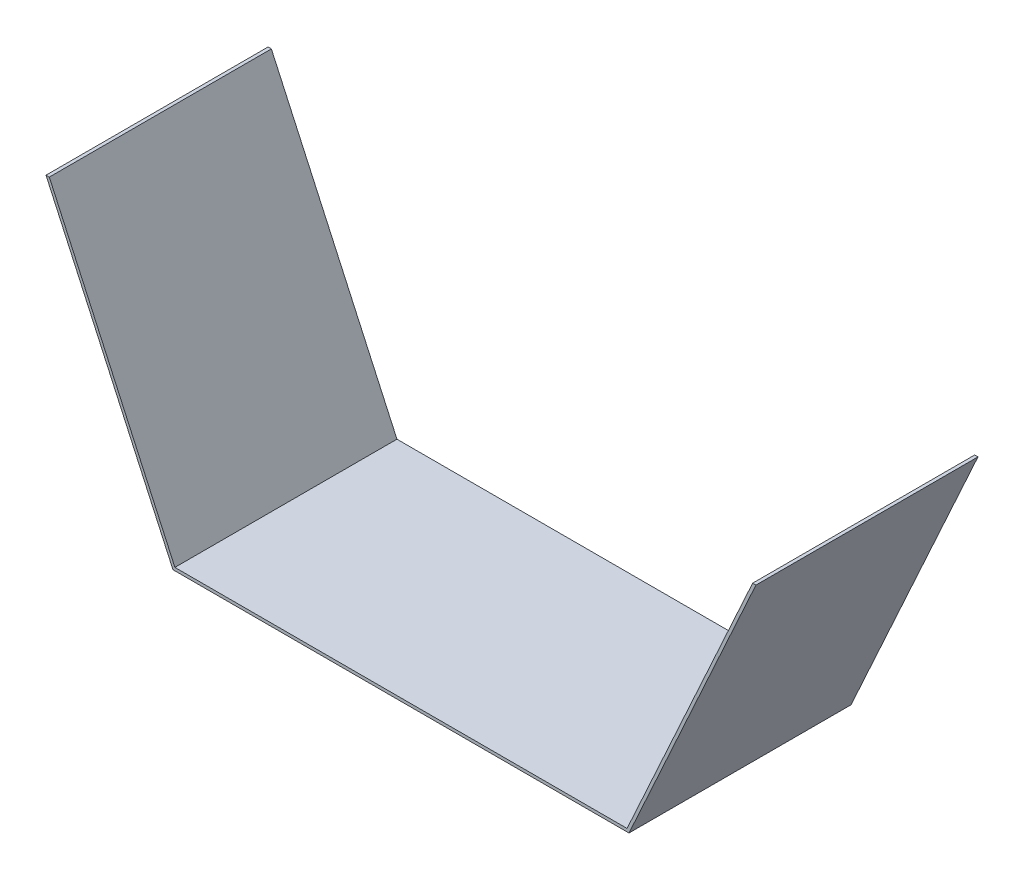
ISO-10303-21;
HEADER;
FILE_DESCRIPTION(('STEP AP214'),'2;1');
FILE_NAME('part.step','',(''),(''),'','','');
FILE_SCHEMA(('AUTOMOTIVE_DESIGN { 1 0 10303 214 1 1 1 1 }'));
ENDSEC;
DATA;
#1=APPLICATION_CONTEXT('core data for automotive mechanical design processes');
#2=APPLICATION_PROTOCOL_DEFINITION('international standard','automotive_design',2000,#1);
#3=PRODUCT_CONTEXT('',#1,'mechanical');
#4=PRODUCT('Part','Part','',(#3));
#5=PRODUCT_RELATED_PRODUCT_CATEGORY('part','',(#4));
#6=PRODUCT_DEFINITION_FORMATION('','',#4);
#7=PRODUCT_DEFINITION_CONTEXT('part definition',#1,'design');
#8=PRODUCT_DEFINITION('design','',#6,#7);
#9=PRODUCT_DEFINITION_SHAPE('','',#8);
#10=(LENGTH_UNIT() NAMED_UNIT(*) SI_UNIT(.MILLI.,.METRE.));
#11=(NAMED_UNIT(*) PLANE_ANGLE_UNIT() SI_UNIT($,.RADIAN.));
#12=(NAMED_UNIT(*) SI_UNIT($,.STERADIAN.) SOLID_ANGLE_UNIT());
#13=UNCERTAINTY_MEASURE_WITH_UNIT(LENGTH_MEASURE(1.E-05),#10,'distance_accuracy_value','');
#14=(GEOMETRIC_REPRESENTATION_CONTEXT(3) GLOBAL_UNCERTAINTY_ASSIGNED_CONTEXT((#13)) GLOBAL_UNIT_ASSIGNED_CONTEXT((#10,
#11,#12)) REPRESENTATION_CONTEXT('',''));
#15=CARTESIAN_POINT('',(0.,0.,0.));
#16=DIRECTION('',(0.,0.,1.));
#17=DIRECTION('',(1.,0.,0.));
#18=AXIS2_PLACEMENT_3D('',#15,#16,#17);
#19=CARTESIAN_POINT('',(114.3,-177.8,112.268));
#20=DIRECTION('',(0.909747292418773,-0.415162454873646,0.));
#21=DIRECTION('',(0.415162454873646,0.909747292418773,0.));
#22=AXIS2_PLACEMENT_3D('',#19,#20,#21);
#23=PLANE('',#22);
#24=DIRECTION('',(-0.415162454873646,-0.909747292418773,0.));
#25=VECTOR('',#24,1.);
#26=CARTESIAN_POINT('',(114.3,-177.8,0.));
#27=LINE('',#26,#25);
#28=CARTESIAN_POINT('',(177.8,-38.6521739130435,0.));
#29=VERTEX_POINT('',#28);
#30=CARTESIAN_POINT('',(114.3,-177.8,0.));
#31=VERTEX_POINT('',#30);
#32=EDGE_CURVE('E140',#29,#31,#27,.T.);
#33=ORIENTED_EDGE('',*,*,#32,.T.);
#34=DIRECTION('',(0.,0.,-1.));
#35=VECTOR('',#34,1.);
#36=CARTESIAN_POINT('',(114.3,-177.8,112.268));
#37=LINE('',#36,#35);
#38=CARTESIAN_POINT('',(114.3,-177.8,112.268));
#39=VERTEX_POINT('',#38);
#40=EDGE_CURVE('E11',#39,#31,#37,.T.);
#41=ORIENTED_EDGE('',*,*,#40,.F.);
#42=DIRECTION('',(-0.415162454873646,-0.909747292418773,0.));
#43=VECTOR('',#42,1.);
#44=CARTESIAN_POINT('',(114.3,-177.8,112.268));
#45=LINE('',#44,#43);
#46=CARTESIAN_POINT('',(177.8,-38.6521739130435,112.268));
#47=VERTEX_POINT('',#46);
#48=EDGE_CURVE('E162',#47,#39,#45,.T.);
#49=ORIENTED_EDGE('',*,*,#48,.F.);
#50=DIRECTION('',(0.,0.,-1.));
#51=VECTOR('',#50,1.);
#52=CARTESIAN_POINT('',(177.8,-38.6521739130435,112.268));
#53=LINE('',#52,#51);
#54=EDGE_CURVE('E136',#47,#29,#53,.T.);
#55=ORIENTED_EDGE('',*,*,#54,.T.);
#56=EDGE_LOOP('',(#33,#41,#49,#55));
#57=FACE_BOUND('',#56,.T.);
#58=ADVANCED_FACE('F39',(#57),#23,.F.);
#59=CARTESIAN_POINT('',(-114.3,-177.8,112.268));
#60=DIRECTION('',(0.,-1.,0.));
#61=DIRECTION('',(0.,0.,-1.));
#62=AXIS2_PLACEMENT_3D('',#59,#60,#61);
#63=PLANE('',#62);
#64=DIRECTION('',(-1.,0.,0.));
#65=VECTOR('',#64,1.);
#66=CARTESIAN_POINT('',(-114.3,-177.8,0.));
#67=LINE('',#66,#65);
#68=CARTESIAN_POINT('',(-114.3,-177.8,0.));
#69=VERTEX_POINT('',#68);
#70=EDGE_CURVE('E144',#31,#69,#67,.T.);
#71=ORIENTED_EDGE('',*,*,#70,.T.);
#72=DIRECTION('',(0.,0.,-1.));
#73=VECTOR('',#72,1.);
#74=CARTESIAN_POINT('',(-114.3,-177.8,112.268));
#75=LINE('',#74,#73);
#76=CARTESIAN_POINT('',(-114.3,-177.8,112.268));
#77=VERTEX_POINT('',#76);
#78=EDGE_CURVE('E48',#77,#69,#75,.T.);
#79=ORIENTED_EDGE('',*,*,#78,.F.);
#80=DIRECTION('',(-1.,0.,0.));
#81=VECTOR('',#80,1.);
#82=CARTESIAN_POINT('',(-114.3,-177.8,112.268));
#83=LINE('',#82,#81);
#84=EDGE_CURVE('E99',#39,#77,#83,.T.);
#85=ORIENTED_EDGE('',*,*,#84,.F.);
#86=ORIENTED_EDGE('',*,*,#40,.T.);
#87=EDGE_LOOP('',(#71,#79,#85,#86));
#88=FACE_BOUND('',#87,.T.);
#89=ADVANCED_FACE('F208',(#88),#63,.F.);
#90=CARTESIAN_POINT('',(-114.3,-177.8,112.268));
#91=DIRECTION('',(-0.909747292418773,-0.415162454873646,0.));
#92=DIRECTION('',(0.415162454873646,-0.909747292418773,0.));
#93=AXIS2_PLACEMENT_3D('',#90,#91,#92);
#94=PLANE('',#93);
#95=DIRECTION('',(-0.415162454873646,0.909747292418773,0.));
#96=VECTOR('',#95,1.);
#97=CARTESIAN_POINT('',(-114.3,-177.8,0.));
#98=LINE('',#97,#96);
#99=CARTESIAN_POINT('',(-177.8,-38.6521739130435,0.));
#100=VERTEX_POINT('',#99);
#101=EDGE_CURVE('E147',#69,#100,#98,.T.);
#102=ORIENTED_EDGE('',*,*,#101,.T.);
#103=DIRECTION('',(0.,0.,-1.));
#104=VECTOR('',#103,1.);
#105=CARTESIAN_POINT('',(-177.8,-38.6521739130435,112.268));
#106=LINE('',#105,#104);
#107=CARTESIAN_POINT('',(-177.8,-38.6521739130435,112.268));
#108=VERTEX_POINT('',#107);
#109=EDGE_CURVE('E173',#108,#100,#106,.T.);
#110=ORIENTED_EDGE('',*,*,#109,.F.);
#111=DIRECTION('',(-0.415162454873646,0.909747292418773,0.));
#112=VECTOR('',#111,1.);
#113=CARTESIAN_POINT('',(-114.3,-177.8,112.268));
#114=LINE('',#113,#112);
#115=EDGE_CURVE('E183',#77,#108,#114,.T.);
#116=ORIENTED_EDGE('',*,*,#115,.F.);
#117=ORIENTED_EDGE('',*,*,#78,.T.);
#118=EDGE_LOOP('',(#102,#110,#116,#117));
#119=FACE_BOUND('',#118,.T.);
#120=ADVANCED_FACE('F181',(#119),#94,.F.);
#121=CARTESIAN_POINT('',(-177.8,-38.6521739130435,112.268));
#122=DIRECTION('',(0.,-1.,0.));
#123=DIRECTION('',(1.,0.,0.));
#124=AXIS2_PLACEMENT_3D('',#121,#122,#123);
#125=PLANE('',#124);
#126=DIRECTION('',(-1.,0.,0.));
#127=VECTOR('',#126,1.);
#128=CARTESIAN_POINT('',(-177.8,-38.6521739130435,0.));
#129=LINE('',#128,#127);
#130=CARTESIAN_POINT('',(-179.469606507936,-38.6521739130433,0.));
#131=VERTEX_POINT('',#130);
#132=EDGE_CURVE('E150',#100,#131,#129,.T.);
#133=ORIENTED_EDGE('',*,*,#132,.T.);
#134=DIRECTION('',(0.,0.,-1.));
#135=VECTOR('',#134,1.);
#136=CARTESIAN_POINT('',(-179.469606507936,-38.6521739130433,112.268));
#137=LINE('',#136,#135);
#138=CARTESIAN_POINT('',(-179.469606507936,-38.6521739130433,112.268));
#139=VERTEX_POINT('',#138);
#140=EDGE_CURVE('E169',#139,#131,#137,.T.);
#141=ORIENTED_EDGE('',*,*,#140,.F.);
#142=DIRECTION('',(-1.,0.,0.));
#143=VECTOR('',#142,1.);
#144=CARTESIAN_POINT('',(-177.8,-38.6521739130435,112.268));
#145=LINE('',#144,#143);
#146=EDGE_CURVE('E196',#108,#139,#145,.T.);
#147=ORIENTED_EDGE('',*,*,#146,.F.);
#148=ORIENTED_EDGE('',*,*,#109,.T.);
#149=EDGE_LOOP('',(#133,#141,#147,#148));
#150=FACE_BOUND('',#149,.T.);
#151=ADVANCED_FACE('F191',(#150),#125,.F.);
#152=CARTESIAN_POINT('',(-179.469606507936,-38.6521739130433,112.268));
#153=DIRECTION('',(0.909747292418773,0.415162454873645,0.));
#154=DIRECTION('',(-0.415162454873645,0.909747292418773,0.));
#155=AXIS2_PLACEMENT_3D('',#152,#153,#154);
#156=PLANE('',#155);
#157=DIRECTION('',(0.415162454873645,-0.909747292418773,0.));
#158=VECTOR('',#157,1.);
#159=CARTESIAN_POINT('',(-179.469606507936,-38.6521739130433,0.));
#160=LINE('',#159,#158);
#161=CARTESIAN_POINT('',(-115.276448571429,-179.31892,0.));
#162=VERTEX_POINT('',#161);
#163=EDGE_CURVE('E153',#131,#162,#160,.T.);
#164=ORIENTED_EDGE('',*,*,#163,.T.);
#165=DIRECTION('',(0.,0.,-1.));
#166=VECTOR('',#165,1.);
#167=CARTESIAN_POINT('',(-115.276448571429,-179.31892,112.268));
#168=LINE('',#167,#166);
#169=CARTESIAN_POINT('',(-115.276448571429,-179.31892,112.268));
#170=VERTEX_POINT('',#169);
#171=EDGE_CURVE('E129',#170,#162,#168,.T.);
#172=ORIENTED_EDGE('',*,*,#171,.F.);
#173=DIRECTION('',(0.415162454873645,-0.909747292418773,0.));
#174=VECTOR('',#173,1.);
#175=CARTESIAN_POINT('',(-179.469606507936,-38.6521739130433,112.268));
#176=LINE('',#175,#174);
#177=EDGE_CURVE('E118',#139,#170,#176,.T.);
#178=ORIENTED_EDGE('',*,*,#177,.F.);
#179=ORIENTED_EDGE('',*,*,#140,.T.);
#180=EDGE_LOOP('',(#164,#172,#178,#179));
#181=FACE_BOUND('',#180,.T.);
#182=ADVANCED_FACE('F194',(#181),#156,.F.);
#183=CARTESIAN_POINT('',(-115.276448571429,-179.31892,112.268));
#184=DIRECTION('',(0.,1.,0.));
#185=DIRECTION('',(0.,0.,1.));
#186=AXIS2_PLACEMENT_3D('',#183,#184,#185);
#187=PLANE('',#186);
#188=DIRECTION('',(1.,0.,0.));
#189=VECTOR('',#188,1.);
#190=CARTESIAN_POINT('',(-115.276448571429,-179.31892,0.));
#191=LINE('',#190,#189);
#192=CARTESIAN_POINT('',(115.276448571429,-179.31892,0.));
#193=VERTEX_POINT('',#192);
#194=EDGE_CURVE('E127',#162,#193,#191,.T.);
#195=ORIENTED_EDGE('',*,*,#194,.T.);
#196=DIRECTION('',(0.,0.,-1.));
#197=VECTOR('',#196,1.);
#198=CARTESIAN_POINT('',(115.276448571429,-179.31892,112.268));
#199=LINE('',#198,#197);
#200=CARTESIAN_POINT('',(115.276448571429,-179.31892,112.268));
#201=VERTEX_POINT('',#200);
#202=EDGE_CURVE('E124',#201,#193,#199,.T.);
#203=ORIENTED_EDGE('',*,*,#202,.F.);
#204=DIRECTION('',(1.,0.,0.));
#205=VECTOR('',#204,1.);
#206=CARTESIAN_POINT('',(-115.276448571429,-179.31892,112.268));
#207=LINE('',#206,#205);
#208=EDGE_CURVE('E112',#170,#201,#207,.T.);
#209=ORIENTED_EDGE('',*,*,#208,.F.);
#210=ORIENTED_EDGE('',*,*,#171,.T.);
#211=EDGE_LOOP('',(#195,#203,#209,#210));
#212=FACE_BOUND('',#211,.T.);
#213=ADVANCED_FACE('F125',(#212),#187,.F.);
#214=CARTESIAN_POINT('',(115.276448571429,-179.31892,112.268));
#215=DIRECTION('',(-0.909747292418773,0.415162454873646,0.));
#216=DIRECTION('',(-0.415162454873646,-0.909747292418773,0.));
#217=AXIS2_PLACEMENT_3D('',#214,#215,#216);
#218=PLANE('',#217);
#219=DIRECTION('',(0.415162454873646,0.909747292418773,0.));
#220=VECTOR('',#219,1.);
#221=CARTESIAN_POINT('',(115.276448571429,-179.31892,0.));
#222=LINE('',#221,#220);
#223=CARTESIAN_POINT('',(179.469606507937,-38.652173913043,0.));
#224=VERTEX_POINT('',#223);
#225=EDGE_CURVE('E85',#193,#224,#222,.T.);
#226=ORIENTED_EDGE('',*,*,#225,.T.);
#227=DIRECTION('',(0.,0.,-1.));
#228=VECTOR('',#227,1.);
#229=CARTESIAN_POINT('',(179.469606507937,-38.652173913043,112.268));
#230=LINE('',#229,#228);
#231=CARTESIAN_POINT('',(179.469606507937,-38.652173913043,112.268));
#232=VERTEX_POINT('',#231);
#233=EDGE_CURVE('E130',#232,#224,#230,.T.);
#234=ORIENTED_EDGE('',*,*,#233,.F.);
#235=DIRECTION('',(0.415162454873646,0.909747292418773,0.));
#236=VECTOR('',#235,1.);
#237=CARTESIAN_POINT('',(115.276448571429,-179.31892,112.268));
#238=LINE('',#237,#236);
#239=EDGE_CURVE('E116',#201,#232,#238,.T.);
#240=ORIENTED_EDGE('',*,*,#239,.F.);
#241=ORIENTED_EDGE('',*,*,#202,.T.);
#242=EDGE_LOOP('',(#226,#234,#240,#241));
#243=FACE_BOUND('',#242,.T.);
#244=ADVANCED_FACE('F132',(#243),#218,.F.);
#245=CARTESIAN_POINT('',(179.469606507937,-38.652173913043,112.268));
#246=DIRECTION('',(2.57672343751172E-13,-1.,0.));
#247=DIRECTION('',(1.,2.57672343751172E-13,0.));
#248=AXIS2_PLACEMENT_3D('',#245,#246,#247);
#249=PLANE('',#248);
#250=DIRECTION('',(-1.,-2.57672343751172E-13,0.));
#251=VECTOR('',#250,1.);
#252=CARTESIAN_POINT('',(179.469606507937,-38.652173913043,0.));
#253=LINE('',#252,#251);
#254=EDGE_CURVE('E91',#224,#29,#253,.T.);
#255=ORIENTED_EDGE('',*,*,#254,.T.);
#256=ORIENTED_EDGE('',*,*,#54,.F.);
#257=DIRECTION('',(-1.,-2.57672343751172E-13,0.));
#258=VECTOR('',#257,1.);
#259=CARTESIAN_POINT('',(179.469606507937,-38.652173913043,112.268));
#260=LINE('',#259,#258);
#261=EDGE_CURVE('E56',#232,#47,#260,.T.);
#262=ORIENTED_EDGE('',*,*,#261,.F.);
#263=ORIENTED_EDGE('',*,*,#233,.T.);
#264=EDGE_LOOP('',(#255,#256,#262,#263));
#265=FACE_BOUND('',#264,.T.);
#266=ADVANCED_FACE('F224',(#265),#249,.F.);
#267=CARTESIAN_POINT('',(0.,0.,112.268));
#268=DIRECTION('',(0.,0.,1.));
#269=DIRECTION('',(1.,0.,0.));
#270=AXIS2_PLACEMENT_3D('',#267,#268,#269);
#271=PLANE('',#270);
#272=ORIENTED_EDGE('',*,*,#48,.T.);
#273=ORIENTED_EDGE('',*,*,#84,.T.);
#274=ORIENTED_EDGE('',*,*,#115,.T.);
#275=ORIENTED_EDGE('',*,*,#146,.T.);
#276=ORIENTED_EDGE('',*,*,#177,.T.);
#277=ORIENTED_EDGE('',*,*,#208,.T.);
#278=ORIENTED_EDGE('',*,*,#239,.T.);
#279=ORIENTED_EDGE('',*,*,#261,.T.);
#280=EDGE_LOOP('',(#272,#273,#274,#275,#276,#277,#278,#279));
#281=FACE_BOUND('',#280,.T.);
#282=ADVANCED_FACE('F114',(#281),#271,.T.);
#283=CARTESIAN_POINT('',(0.,0.,0.));
#284=DIRECTION('',(0.,0.,1.));
#285=DIRECTION('',(1.,0.,0.));
#286=AXIS2_PLACEMENT_3D('',#283,#284,#285);
#287=PLANE('',#286);
#288=ORIENTED_EDGE('',*,*,#32,.F.);
#289=ORIENTED_EDGE('',*,*,#254,.F.);
#290=ORIENTED_EDGE('',*,*,#225,.F.);
#291=ORIENTED_EDGE('',*,*,#194,.F.);
#292=ORIENTED_EDGE('',*,*,#163,.F.);
#293=ORIENTED_EDGE('',*,*,#132,.F.);
#294=ORIENTED_EDGE('',*,*,#101,.F.);
#295=ORIENTED_EDGE('',*,*,#70,.F.);
#296=EDGE_LOOP('',(#288,#289,#290,#291,#292,#293,#294,#295));
#297=FACE_BOUND('',#296,.T.);
#298=ADVANCED_FACE('F187',(#297),#287,.F.);
#299=CLOSED_SHELL('',(#58,#89,#120,#151,#182,#213,#244,#266,#282,#298));
#300=MANIFOLD_SOLID_BREP('B2',#299);
#301=ADVANCED_BREP_SHAPE_REPRESENTATION('',(#18,#300),#14);
#302=SHAPE_DEFINITION_REPRESENTATION(#9,#301);
ENDSEC;
END-ISO-10303-21;
